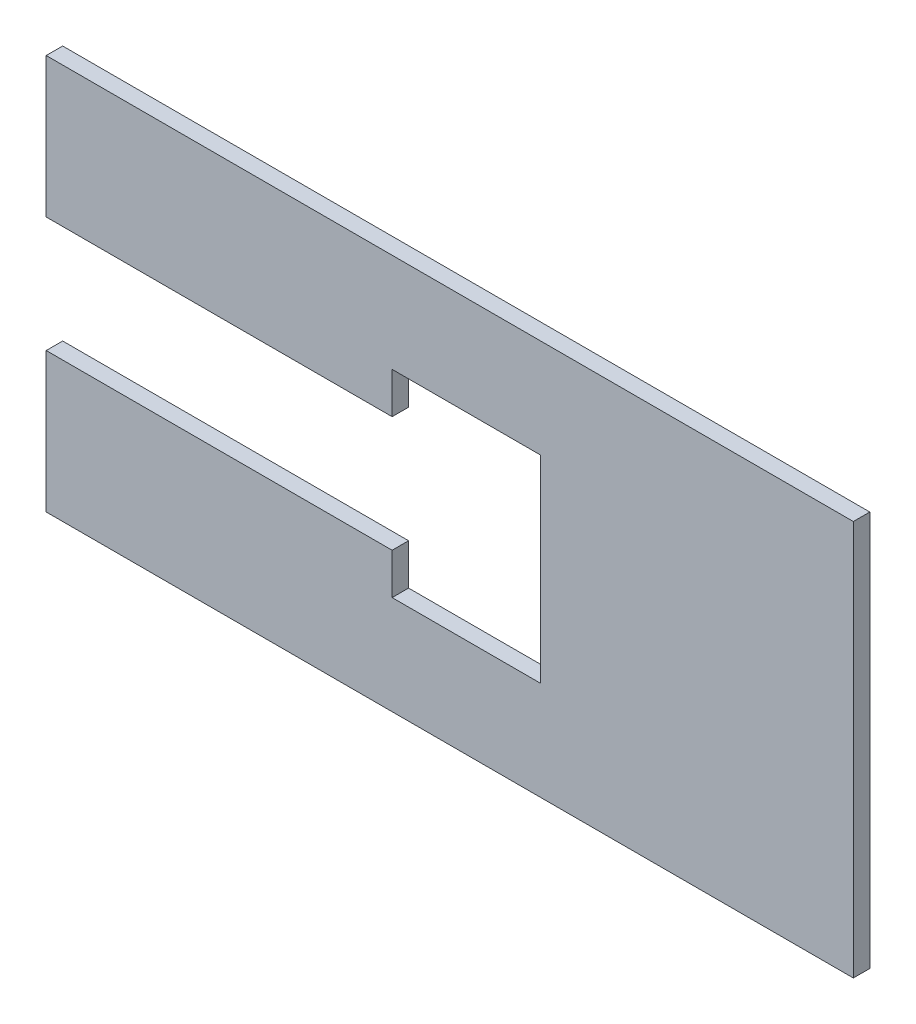
ISO-10303-21;
HEADER;
FILE_DESCRIPTION(('STEP AP214'),'2;1');
FILE_NAME('part.step','',(''),(''),'','','');
FILE_SCHEMA(('AUTOMOTIVE_DESIGN { 1 0 10303 214 1 1 1 1 }'));
ENDSEC;
DATA;
#1=APPLICATION_CONTEXT('core data for automotive mechanical design processes');
#2=APPLICATION_PROTOCOL_DEFINITION('international standard','automotive_design',2000,#1);
#3=PRODUCT_CONTEXT('',#1,'mechanical');
#4=PRODUCT('Part','Part','',(#3));
#5=PRODUCT_RELATED_PRODUCT_CATEGORY('part','',(#4));
#6=PRODUCT_DEFINITION_FORMATION('','',#4);
#7=PRODUCT_DEFINITION_CONTEXT('part definition',#1,'design');
#8=PRODUCT_DEFINITION('design','',#6,#7);
#9=PRODUCT_DEFINITION_SHAPE('','',#8);
#10=(LENGTH_UNIT() NAMED_UNIT(*) SI_UNIT(.MILLI.,.METRE.));
#11=(NAMED_UNIT(*) PLANE_ANGLE_UNIT() SI_UNIT($,.RADIAN.));
#12=(NAMED_UNIT(*) SI_UNIT($,.STERADIAN.) SOLID_ANGLE_UNIT());
#13=UNCERTAINTY_MEASURE_WITH_UNIT(LENGTH_MEASURE(1.E-05),#10,'distance_accuracy_value','');
#14=(GEOMETRIC_REPRESENTATION_CONTEXT(3) GLOBAL_UNCERTAINTY_ASSIGNED_CONTEXT((#13)) GLOBAL_UNIT_ASSIGNED_CONTEXT((#10,
#11,#12)) REPRESENTATION_CONTEXT('',''));
#15=CARTESIAN_POINT('',(0.,0.,0.));
#16=DIRECTION('',(0.,0.,1.));
#17=DIRECTION('',(1.,0.,0.));
#18=AXIS2_PLACEMENT_3D('',#15,#16,#17);
#19=CARTESIAN_POINT('',(-122.5,-60.,5.));
#20=DIRECTION('',(1.,0.,0.));
#21=DIRECTION('',(0.,0.,-1.));
#22=AXIS2_PLACEMENT_3D('',#19,#20,#21);
#23=PLANE('',#22);
#24=DIRECTION('',(0.,-1.,0.));
#25=VECTOR('',#24,1.);
#26=CARTESIAN_POINT('',(-122.5,-60.,0.));
#27=LINE('',#26,#25);
#28=CARTESIAN_POINT('',(-122.5,60.,0.));
#29=VERTEX_POINT('',#28);
#30=CARTESIAN_POINT('',(-122.5,17.55,0.));
#31=VERTEX_POINT('',#30);
#32=EDGE_CURVE('E151',#29,#31,#27,.T.);
#33=ORIENTED_EDGE('',*,*,#32,.T.);
#34=DIRECTION('',(0.,0.,1.));
#35=VECTOR('',#34,1.);
#36=CARTESIAN_POINT('',(-122.5,17.55,0.));
#37=LINE('',#36,#35);
#38=CARTESIAN_POINT('',(-122.5,17.55,5.));
#39=VERTEX_POINT('',#38);
#40=EDGE_CURVE('E152',#31,#39,#37,.T.);
#41=ORIENTED_EDGE('',*,*,#40,.T.);
#42=DIRECTION('',(0.,-1.,0.));
#43=VECTOR('',#42,1.);
#44=CARTESIAN_POINT('',(-122.5,-60.,5.));
#45=LINE('',#44,#43);
#46=CARTESIAN_POINT('',(-122.5,60.,5.));
#47=VERTEX_POINT('',#46);
#48=EDGE_CURVE('E181',#47,#39,#45,.T.);
#49=ORIENTED_EDGE('',*,*,#48,.F.);
#50=DIRECTION('',(0.,0.,-1.));
#51=VECTOR('',#50,1.);
#52=CARTESIAN_POINT('',(-122.5,60.,5.));
#53=LINE('',#52,#51);
#54=EDGE_CURVE('E165',#47,#29,#53,.T.);
#55=ORIENTED_EDGE('',*,*,#54,.T.);
#56=EDGE_LOOP('',(#33,#41,#49,#55));
#57=FACE_BOUND('',#56,.T.);
#58=ADVANCED_FACE('F33',(#57),#23,.F.);
#59=CARTESIAN_POINT('',(-122.5,-17.55,5.));
#60=VERTEX_POINT('',#59);
#61=CARTESIAN_POINT('',(-122.5,-60.,5.));
#62=VERTEX_POINT('',#61);
#63=EDGE_CURVE('E85',#60,#62,#45,.T.);
#64=ORIENTED_EDGE('',*,*,#63,.F.);
#65=DIRECTION('',(0.,0.,1.));
#66=VECTOR('',#65,1.);
#67=CARTESIAN_POINT('',(-122.5,-17.55,0.));
#68=LINE('',#67,#66);
#69=CARTESIAN_POINT('',(-122.5,-17.55,0.));
#70=VERTEX_POINT('',#69);
#71=EDGE_CURVE('E135',#70,#60,#68,.T.);
#72=ORIENTED_EDGE('',*,*,#71,.F.);
#73=CARTESIAN_POINT('',(-122.5,-60.,0.));
#74=VERTEX_POINT('',#73);
#75=EDGE_CURVE('E143',#70,#74,#27,.T.);
#76=ORIENTED_EDGE('',*,*,#75,.T.);
#77=DIRECTION('',(0.,0.,-1.));
#78=VECTOR('',#77,1.);
#79=CARTESIAN_POINT('',(-122.5,-60.,5.));
#80=LINE('',#79,#78);
#81=EDGE_CURVE('E11',#62,#74,#80,.T.);
#82=ORIENTED_EDGE('',*,*,#81,.F.);
#83=EDGE_LOOP('',(#64,#72,#76,#82));
#84=FACE_BOUND('',#83,.T.);
#85=ADVANCED_FACE('F35',(#84),#23,.F.);
#86=CARTESIAN_POINT('',(122.5,-60.,5.));
#87=DIRECTION('',(0.,1.,0.));
#88=DIRECTION('',(-1.,0.,0.));
#89=AXIS2_PLACEMENT_3D('',#86,#87,#88);
#90=PLANE('',#89);
#91=DIRECTION('',(1.,0.,0.));
#92=VECTOR('',#91,1.);
#93=CARTESIAN_POINT('',(122.5,-60.,0.));
#94=LINE('',#93,#92);
#95=CARTESIAN_POINT('',(122.5,-60.,0.));
#96=VERTEX_POINT('',#95);
#97=EDGE_CURVE('E150',#74,#96,#94,.T.);
#98=ORIENTED_EDGE('',*,*,#97,.T.);
#99=DIRECTION('',(0.,0.,-1.));
#100=VECTOR('',#99,1.);
#101=CARTESIAN_POINT('',(122.5,-60.,5.));
#102=LINE('',#101,#100);
#103=CARTESIAN_POINT('',(122.5,-60.,5.));
#104=VERTEX_POINT('',#103);
#105=EDGE_CURVE('E41',#104,#96,#102,.T.);
#106=ORIENTED_EDGE('',*,*,#105,.F.);
#107=DIRECTION('',(1.,0.,0.));
#108=VECTOR('',#107,1.);
#109=CARTESIAN_POINT('',(122.5,-60.,5.));
#110=LINE('',#109,#108);
#111=EDGE_CURVE('E183',#62,#104,#110,.T.);
#112=ORIENTED_EDGE('',*,*,#111,.F.);
#113=ORIENTED_EDGE('',*,*,#81,.T.);
#114=EDGE_LOOP('',(#98,#106,#112,#113));
#115=FACE_BOUND('',#114,.T.);
#116=ADVANCED_FACE('F261',(#115),#90,.F.);
#117=CARTESIAN_POINT('',(122.5,-60.,5.));
#118=DIRECTION('',(-1.,0.,0.));
#119=DIRECTION('',(0.,0.,1.));
#120=AXIS2_PLACEMENT_3D('',#117,#118,#119);
#121=PLANE('',#120);
#122=DIRECTION('',(0.,1.,0.));
#123=VECTOR('',#122,1.);
#124=CARTESIAN_POINT('',(122.5,-60.,0.));
#125=LINE('',#124,#123);
#126=CARTESIAN_POINT('',(122.5,60.,0.));
#127=VERTEX_POINT('',#126);
#128=EDGE_CURVE('E162',#96,#127,#125,.T.);
#129=ORIENTED_EDGE('',*,*,#128,.T.);
#130=DIRECTION('',(0.,0.,-1.));
#131=VECTOR('',#130,1.);
#132=CARTESIAN_POINT('',(122.5,60.,5.));
#133=LINE('',#132,#131);
#134=CARTESIAN_POINT('',(122.5,60.,5.));
#135=VERTEX_POINT('',#134);
#136=EDGE_CURVE('E167',#135,#127,#133,.T.);
#137=ORIENTED_EDGE('',*,*,#136,.F.);
#138=DIRECTION('',(0.,1.,0.));
#139=VECTOR('',#138,1.);
#140=CARTESIAN_POINT('',(122.5,-60.,5.));
#141=LINE('',#140,#139);
#142=EDGE_CURVE('E174',#104,#135,#141,.T.);
#143=ORIENTED_EDGE('',*,*,#142,.F.);
#144=ORIENTED_EDGE('',*,*,#105,.T.);
#145=EDGE_LOOP('',(#129,#137,#143,#144));
#146=FACE_BOUND('',#145,.T.);
#147=ADVANCED_FACE('F172',(#146),#121,.F.);
#148=CARTESIAN_POINT('',(122.5,60.,5.));
#149=DIRECTION('',(0.,-1.,0.));
#150=DIRECTION('',(1.,0.,0.));
#151=AXIS2_PLACEMENT_3D('',#148,#149,#150);
#152=PLANE('',#151);
#153=DIRECTION('',(-1.,0.,0.));
#154=VECTOR('',#153,1.);
#155=CARTESIAN_POINT('',(122.5,60.,0.));
#156=LINE('',#155,#154);
#157=EDGE_CURVE('E78',#127,#29,#156,.T.);
#158=ORIENTED_EDGE('',*,*,#157,.T.);
#159=ORIENTED_EDGE('',*,*,#54,.F.);
#160=DIRECTION('',(-1.,0.,0.));
#161=VECTOR('',#160,1.);
#162=CARTESIAN_POINT('',(122.5,60.,5.));
#163=LINE('',#162,#161);
#164=EDGE_CURVE('E57',#135,#47,#163,.T.);
#165=ORIENTED_EDGE('',*,*,#164,.F.);
#166=ORIENTED_EDGE('',*,*,#136,.T.);
#167=EDGE_LOOP('',(#158,#159,#165,#166));
#168=FACE_BOUND('',#167,.T.);
#169=ADVANCED_FACE('F182',(#168),#152,.F.);
#170=CARTESIAN_POINT('',(0.,0.,5.));
#171=DIRECTION('',(0.,0.,1.));
#172=DIRECTION('',(1.,0.,0.));
#173=AXIS2_PLACEMENT_3D('',#170,#171,#172);
#174=PLANE('',#173);
#175=DIRECTION('',(-1.,0.,0.));
#176=VECTOR('',#175,1.);
#177=CARTESIAN_POINT('',(-122.5,17.55,5.));
#178=LINE('',#177,#176);
#179=CARTESIAN_POINT('',(-17.5,17.55,5.));
#180=VERTEX_POINT('',#179);
#181=EDGE_CURVE('E139',#180,#39,#178,.T.);
#182=ORIENTED_EDGE('',*,*,#181,.F.);
#183=DIRECTION('',(0.,-1.,0.));
#184=VECTOR('',#183,1.);
#185=CARTESIAN_POINT('',(-17.5,17.55,5.));
#186=LINE('',#185,#184);
#187=CARTESIAN_POINT('',(-17.5,30.,5.));
#188=VERTEX_POINT('',#187);
#189=EDGE_CURVE('E198',#188,#180,#186,.T.);
#190=ORIENTED_EDGE('',*,*,#189,.F.);
#191=DIRECTION('',(-1.,0.,0.));
#192=VECTOR('',#191,1.);
#193=CARTESIAN_POINT('',(27.5,30.,5.));
#194=LINE('',#193,#192);
#195=CARTESIAN_POINT('',(27.5,30.,5.));
#196=VERTEX_POINT('',#195);
#197=EDGE_CURVE('E201',#196,#188,#194,.T.);
#198=ORIENTED_EDGE('',*,*,#197,.F.);
#199=DIRECTION('',(0.,1.,0.));
#200=VECTOR('',#199,1.);
#201=CARTESIAN_POINT('',(27.5,-30.,5.));
#202=LINE('',#201,#200);
#203=CARTESIAN_POINT('',(27.5,-30.,5.));
#204=VERTEX_POINT('',#203);
#205=EDGE_CURVE('E204',#204,#196,#202,.T.);
#206=ORIENTED_EDGE('',*,*,#205,.F.);
#207=DIRECTION('',(1.,0.,0.));
#208=VECTOR('',#207,1.);
#209=CARTESIAN_POINT('',(27.5,-30.,5.));
#210=LINE('',#209,#208);
#211=CARTESIAN_POINT('',(-17.5,-30.,5.));
#212=VERTEX_POINT('',#211);
#213=EDGE_CURVE('E207',#212,#204,#210,.T.);
#214=ORIENTED_EDGE('',*,*,#213,.F.);
#215=DIRECTION('',(0.,-1.,0.));
#216=VECTOR('',#215,1.);
#217=CARTESIAN_POINT('',(-17.5,-30.,5.));
#218=LINE('',#217,#216);
#219=CARTESIAN_POINT('',(-17.5,-17.55,5.));
#220=VERTEX_POINT('',#219);
#221=EDGE_CURVE('E210',#220,#212,#218,.T.);
#222=ORIENTED_EDGE('',*,*,#221,.F.);
#223=DIRECTION('',(1.,0.,0.));
#224=VECTOR('',#223,1.);
#225=CARTESIAN_POINT('',(-122.5,-17.55,5.));
#226=LINE('',#225,#224);
#227=EDGE_CURVE('E213',#60,#220,#226,.T.);
#228=ORIENTED_EDGE('',*,*,#227,.F.);
#229=ORIENTED_EDGE('',*,*,#63,.T.);
#230=ORIENTED_EDGE('',*,*,#111,.T.);
#231=ORIENTED_EDGE('',*,*,#142,.T.);
#232=ORIENTED_EDGE('',*,*,#164,.T.);
#233=ORIENTED_EDGE('',*,*,#48,.T.);
#234=EDGE_LOOP('',(#182,#190,#198,#206,#214,#222,#228,#229,#230,#231,#232,#233));
#235=FACE_BOUND('',#234,.T.);
#236=ADVANCED_FACE('F246',(#235),#174,.T.);
#237=CARTESIAN_POINT('',(0.,0.,0.));
#238=DIRECTION('',(0.,0.,1.));
#239=DIRECTION('',(1.,0.,0.));
#240=AXIS2_PLACEMENT_3D('',#237,#238,#239);
#241=PLANE('',#240);
#242=DIRECTION('',(0.,-1.,0.));
#243=VECTOR('',#242,1.);
#244=CARTESIAN_POINT('',(-17.5,17.55,0.));
#245=LINE('',#244,#243);
#246=CARTESIAN_POINT('',(-17.5,30.,0.));
#247=VERTEX_POINT('',#246);
#248=CARTESIAN_POINT('',(-17.5,17.55,0.));
#249=VERTEX_POINT('',#248);
#250=EDGE_CURVE('E216',#247,#249,#245,.T.);
#251=ORIENTED_EDGE('',*,*,#250,.T.);
#252=DIRECTION('',(-1.,0.,0.));
#253=VECTOR('',#252,1.);
#254=CARTESIAN_POINT('',(-122.5,17.55,0.));
#255=LINE('',#254,#253);
#256=EDGE_CURVE('E145',#249,#31,#255,.T.);
#257=ORIENTED_EDGE('',*,*,#256,.T.);
#258=ORIENTED_EDGE('',*,*,#32,.F.);
#259=ORIENTED_EDGE('',*,*,#157,.F.);
#260=ORIENTED_EDGE('',*,*,#128,.F.);
#261=ORIENTED_EDGE('',*,*,#97,.F.);
#262=ORIENTED_EDGE('',*,*,#75,.F.);
#263=DIRECTION('',(1.,0.,0.));
#264=VECTOR('',#263,1.);
#265=CARTESIAN_POINT('',(-122.5,-17.55,0.));
#266=LINE('',#265,#264);
#267=CARTESIAN_POINT('',(-17.5,-17.55,0.));
#268=VERTEX_POINT('',#267);
#269=EDGE_CURVE('E131',#70,#268,#266,.T.);
#270=ORIENTED_EDGE('',*,*,#269,.T.);
#271=DIRECTION('',(0.,-1.,0.));
#272=VECTOR('',#271,1.);
#273=CARTESIAN_POINT('',(-17.5,-30.,0.));
#274=LINE('',#273,#272);
#275=CARTESIAN_POINT('',(-17.5,-30.,0.));
#276=VERTEX_POINT('',#275);
#277=EDGE_CURVE('E48',#268,#276,#274,.T.);
#278=ORIENTED_EDGE('',*,*,#277,.T.);
#279=DIRECTION('',(1.,0.,0.));
#280=VECTOR('',#279,1.);
#281=CARTESIAN_POINT('',(27.5,-30.,0.));
#282=LINE('',#281,#280);
#283=CARTESIAN_POINT('',(27.5,-30.,0.));
#284=VERTEX_POINT('',#283);
#285=EDGE_CURVE('E224',#276,#284,#282,.T.);
#286=ORIENTED_EDGE('',*,*,#285,.T.);
#287=DIRECTION('',(0.,1.,0.));
#288=VECTOR('',#287,1.);
#289=CARTESIAN_POINT('',(27.5,-30.,0.));
#290=LINE('',#289,#288);
#291=CARTESIAN_POINT('',(27.5,30.,0.));
#292=VERTEX_POINT('',#291);
#293=EDGE_CURVE('E221',#284,#292,#290,.T.);
#294=ORIENTED_EDGE('',*,*,#293,.T.);
#295=DIRECTION('',(-1.,0.,0.));
#296=VECTOR('',#295,1.);
#297=CARTESIAN_POINT('',(27.5,30.,0.));
#298=LINE('',#297,#296);
#299=EDGE_CURVE('E218',#292,#247,#298,.T.);
#300=ORIENTED_EDGE('',*,*,#299,.T.);
#301=EDGE_LOOP('',(#251,#257,#258,#259,#260,#261,#262,#270,#278,#286,#294,#300));
#302=FACE_BOUND('',#301,.T.);
#303=ADVANCED_FACE('F148',(#302),#241,.F.);
#304=CARTESIAN_POINT('',(-122.5,17.55,0.));
#305=DIRECTION('',(0.,1.,0.));
#306=DIRECTION('',(0.,0.,1.));
#307=AXIS2_PLACEMENT_3D('',#304,#305,#306);
#308=PLANE('',#307);
#309=ORIENTED_EDGE('',*,*,#181,.T.);
#310=ORIENTED_EDGE('',*,*,#40,.F.);
#311=ORIENTED_EDGE('',*,*,#256,.F.);
#312=DIRECTION('',(0.,0.,1.));
#313=VECTOR('',#312,1.);
#314=CARTESIAN_POINT('',(-17.5,17.55,0.));
#315=LINE('',#314,#313);
#316=EDGE_CURVE('E156',#249,#180,#315,.T.);
#317=ORIENTED_EDGE('',*,*,#316,.T.);
#318=EDGE_LOOP('',(#309,#310,#311,#317));
#319=FACE_BOUND('',#318,.T.);
#320=ADVANCED_FACE('F245',(#319),#308,.F.);
#321=CARTESIAN_POINT('',(-17.5,17.55,0.));
#322=DIRECTION('',(-1.,0.,0.));
#323=DIRECTION('',(0.,0.,1.));
#324=AXIS2_PLACEMENT_3D('',#321,#322,#323);
#325=PLANE('',#324);
#326=ORIENTED_EDGE('',*,*,#189,.T.);
#327=ORIENTED_EDGE('',*,*,#316,.F.);
#328=ORIENTED_EDGE('',*,*,#250,.F.);
#329=DIRECTION('',(0.,0.,1.));
#330=VECTOR('',#329,1.);
#331=CARTESIAN_POINT('',(-17.5,30.,0.));
#332=LINE('',#331,#330);
#333=EDGE_CURVE('E194',#247,#188,#332,.T.);
#334=ORIENTED_EDGE('',*,*,#333,.T.);
#335=EDGE_LOOP('',(#326,#327,#328,#334));
#336=FACE_BOUND('',#335,.T.);
#337=ADVANCED_FACE('F241',(#336),#325,.F.);
#338=CARTESIAN_POINT('',(27.5,30.,0.));
#339=DIRECTION('',(0.,1.,0.));
#340=DIRECTION('',(-1.,0.,0.));
#341=AXIS2_PLACEMENT_3D('',#338,#339,#340);
#342=PLANE('',#341);
#343=ORIENTED_EDGE('',*,*,#197,.T.);
#344=ORIENTED_EDGE('',*,*,#333,.F.);
#345=ORIENTED_EDGE('',*,*,#299,.F.);
#346=DIRECTION('',(0.,0.,1.));
#347=VECTOR('',#346,1.);
#348=CARTESIAN_POINT('',(27.5,30.,0.));
#349=LINE('',#348,#347);
#350=EDGE_CURVE('E192',#292,#196,#349,.T.);
#351=ORIENTED_EDGE('',*,*,#350,.T.);
#352=EDGE_LOOP('',(#343,#344,#345,#351));
#353=FACE_BOUND('',#352,.T.);
#354=ADVANCED_FACE('F238',(#353),#342,.F.);
#355=CARTESIAN_POINT('',(27.5,-30.,0.));
#356=DIRECTION('',(1.,0.,0.));
#357=DIRECTION('',(0.,0.,-1.));
#358=AXIS2_PLACEMENT_3D('',#355,#356,#357);
#359=PLANE('',#358);
#360=ORIENTED_EDGE('',*,*,#205,.T.);
#361=ORIENTED_EDGE('',*,*,#350,.F.);
#362=ORIENTED_EDGE('',*,*,#293,.F.);
#363=DIRECTION('',(0.,0.,1.));
#364=VECTOR('',#363,1.);
#365=CARTESIAN_POINT('',(27.5,-30.,0.));
#366=LINE('',#365,#364);
#367=EDGE_CURVE('E190',#284,#204,#366,.T.);
#368=ORIENTED_EDGE('',*,*,#367,.T.);
#369=EDGE_LOOP('',(#360,#361,#362,#368));
#370=FACE_BOUND('',#369,.T.);
#371=ADVANCED_FACE('F234',(#370),#359,.F.);
#372=CARTESIAN_POINT('',(27.5,-30.,0.));
#373=DIRECTION('',(0.,-1.,0.));
#374=DIRECTION('',(1.,0.,0.));
#375=AXIS2_PLACEMENT_3D('',#372,#373,#374);
#376=PLANE('',#375);
#377=ORIENTED_EDGE('',*,*,#213,.T.);
#378=ORIENTED_EDGE('',*,*,#367,.F.);
#379=ORIENTED_EDGE('',*,*,#285,.F.);
#380=DIRECTION('',(0.,0.,1.));
#381=VECTOR('',#380,1.);
#382=CARTESIAN_POINT('',(-17.5,-30.,0.));
#383=LINE('',#382,#381);
#384=EDGE_CURVE('E188',#276,#212,#383,.T.);
#385=ORIENTED_EDGE('',*,*,#384,.T.);
#386=EDGE_LOOP('',(#377,#378,#379,#385));
#387=FACE_BOUND('',#386,.T.);
#388=ADVANCED_FACE('F230',(#387),#376,.F.);
#389=CARTESIAN_POINT('',(-17.5,-30.,0.));
#390=DIRECTION('',(-1.,0.,0.));
#391=DIRECTION('',(0.,0.,1.));
#392=AXIS2_PLACEMENT_3D('',#389,#390,#391);
#393=PLANE('',#392);
#394=ORIENTED_EDGE('',*,*,#221,.T.);
#395=ORIENTED_EDGE('',*,*,#384,.F.);
#396=ORIENTED_EDGE('',*,*,#277,.F.);
#397=DIRECTION('',(0.,0.,1.));
#398=VECTOR('',#397,1.);
#399=CARTESIAN_POINT('',(-17.5,-17.55,0.));
#400=LINE('',#399,#398);
#401=EDGE_CURVE('E136',#268,#220,#400,.T.);
#402=ORIENTED_EDGE('',*,*,#401,.T.);
#403=EDGE_LOOP('',(#394,#395,#396,#402));
#404=FACE_BOUND('',#403,.T.);
#405=ADVANCED_FACE('F248',(#404),#393,.F.);
#406=CARTESIAN_POINT('',(-122.5,-17.55,0.));
#407=DIRECTION('',(0.,-1.,0.));
#408=DIRECTION('',(0.,0.,-1.));
#409=AXIS2_PLACEMENT_3D('',#406,#407,#408);
#410=PLANE('',#409);
#411=ORIENTED_EDGE('',*,*,#227,.T.);
#412=ORIENTED_EDGE('',*,*,#401,.F.);
#413=ORIENTED_EDGE('',*,*,#269,.F.);
#414=ORIENTED_EDGE('',*,*,#71,.T.);
#415=EDGE_LOOP('',(#411,#412,#413,#414));
#416=FACE_BOUND('',#415,.T.);
#417=ADVANCED_FACE('F134',(#416),#410,.F.);
#418=CLOSED_SHELL('',(#58,#85,#116,#147,#169,#236,#303,#320,#337,#354,#371,#388,#405,#417));
#419=MANIFOLD_SOLID_BREP('B2',#418);
#420=ADVANCED_BREP_SHAPE_REPRESENTATION('',(#18,#419),#14);
#421=SHAPE_DEFINITION_REPRESENTATION(#9,#420);
ENDSEC;
END-ISO-10303-21;
